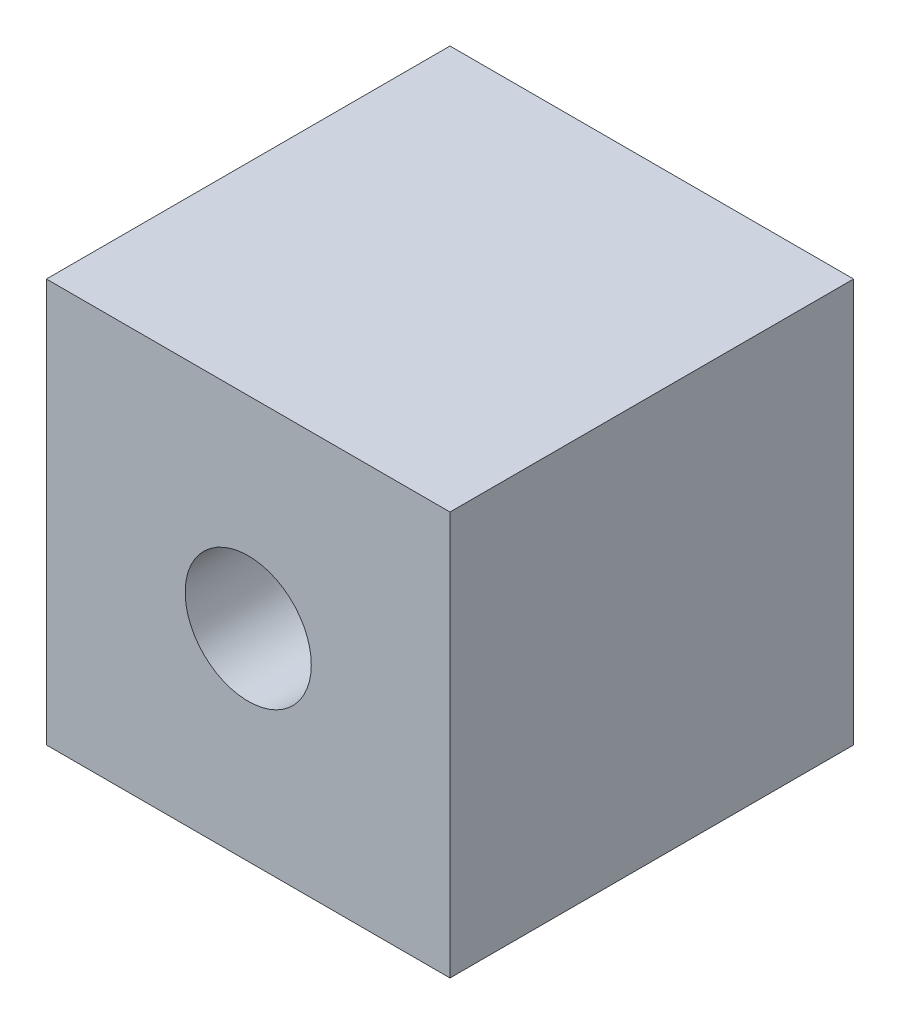
ISO-10303-21;
HEADER;
FILE_DESCRIPTION(('STEP AP214'),'2;1');
FILE_NAME('part.step','',(''),(''),'','','');
FILE_SCHEMA(('AUTOMOTIVE_DESIGN { 1 0 10303 214 1 1 1 1 }'));
ENDSEC;
DATA;
#1=APPLICATION_CONTEXT('core data for automotive mechanical design processes');
#2=APPLICATION_PROTOCOL_DEFINITION('international standard','automotive_design',2000,#1);
#3=PRODUCT_CONTEXT('',#1,'mechanical');
#4=PRODUCT('Part','Part','',(#3));
#5=PRODUCT_RELATED_PRODUCT_CATEGORY('part','',(#4));
#6=PRODUCT_DEFINITION_FORMATION('','',#4);
#7=PRODUCT_DEFINITION_CONTEXT('part definition',#1,'design');
#8=PRODUCT_DEFINITION('design','',#6,#7);
#9=PRODUCT_DEFINITION_SHAPE('','',#8);
#10=(LENGTH_UNIT() NAMED_UNIT(*) SI_UNIT(.MILLI.,.METRE.));
#11=(NAMED_UNIT(*) PLANE_ANGLE_UNIT() SI_UNIT($,.RADIAN.));
#12=(NAMED_UNIT(*) SI_UNIT($,.STERADIAN.) SOLID_ANGLE_UNIT());
#13=UNCERTAINTY_MEASURE_WITH_UNIT(LENGTH_MEASURE(1.E-05),#10,'distance_accuracy_value','');
#14=(GEOMETRIC_REPRESENTATION_CONTEXT(3) GLOBAL_UNCERTAINTY_ASSIGNED_CONTEXT((#13)) GLOBAL_UNIT_ASSIGNED_CONTEXT((#10,
#11,#12)) REPRESENTATION_CONTEXT('',''));
#15=CARTESIAN_POINT('',(0.,0.,0.));
#16=DIRECTION('',(0.,0.,1.));
#17=DIRECTION('',(1.,0.,0.));
#18=AXIS2_PLACEMENT_3D('',#15,#16,#17);
#19=CARTESIAN_POINT('',(24.,48.,24.));
#20=DIRECTION('',(-1.,0.,0.));
#21=DIRECTION('',(0.,0.,1.));
#22=AXIS2_PLACEMENT_3D('',#19,#20,#21);
#23=PLANE('',#22);
#24=DIRECTION('',(0.,0.,-1.));
#25=VECTOR('',#24,1.);
#26=CARTESIAN_POINT('',(24.,0.,24.));
#27=LINE('',#26,#25);
#28=CARTESIAN_POINT('',(24.,0.,24.));
#29=VERTEX_POINT('',#28);
#30=CARTESIAN_POINT('',(24.,0.,-24.));
#31=VERTEX_POINT('',#30);
#32=EDGE_CURVE('E95',#29,#31,#27,.T.);
#33=ORIENTED_EDGE('',*,*,#32,.T.);
#34=DIRECTION('',(0.,-1.,0.));
#35=VECTOR('',#34,1.);
#36=CARTESIAN_POINT('',(24.,48.,-24.));
#37=LINE('',#36,#35);
#38=CARTESIAN_POINT('',(24.,48.,-24.));
#39=VERTEX_POINT('',#38);
#40=EDGE_CURVE('E11',#39,#31,#37,.T.);
#41=ORIENTED_EDGE('',*,*,#40,.F.);
#42=DIRECTION('',(0.,0.,-1.));
#43=VECTOR('',#42,1.);
#44=CARTESIAN_POINT('',(24.,48.,24.));
#45=LINE('',#44,#43);
#46=CARTESIAN_POINT('',(24.,48.,24.));
#47=VERTEX_POINT('',#46);
#48=EDGE_CURVE('E83',#47,#39,#45,.T.);
#49=ORIENTED_EDGE('',*,*,#48,.F.);
#50=DIRECTION('',(0.,-1.,0.));
#51=VECTOR('',#50,1.);
#52=CARTESIAN_POINT('',(24.,48.,24.));
#53=LINE('',#52,#51);
#54=EDGE_CURVE('E91',#47,#29,#53,.T.);
#55=ORIENTED_EDGE('',*,*,#54,.T.);
#56=EDGE_LOOP('',(#33,#41,#49,#55));
#57=FACE_BOUND('',#56,.T.);
#58=ADVANCED_FACE('F32',(#57),#23,.F.);
#59=CARTESIAN_POINT('',(-24.,48.,-24.));
#60=DIRECTION('',(0.,0.,1.));
#61=DIRECTION('',(1.,0.,0.));
#62=AXIS2_PLACEMENT_3D('',#59,#60,#61);
#63=PLANE('',#62);
#64=CARTESIAN_POINT('',(0.,24.,-24.));
#65=DIRECTION('',(0.,0.,1.));
#66=DIRECTION('',(1.,0.,0.));
#67=AXIS2_PLACEMENT_3D('',#64,#65,#66);
#68=CIRCLE('',#67,7.5);
#69=CARTESIAN_POINT('',(7.5,24.,-24.));
#70=VERTEX_POINT('',#69);
#71=EDGE_CURVE('E98',#70,#70,#68,.T.);
#72=ORIENTED_EDGE('',*,*,#71,.T.);
#73=EDGE_LOOP('',(#72));
#74=FACE_BOUND('',#73,.T.);
#75=DIRECTION('',(-1.,0.,0.));
#76=VECTOR('',#75,1.);
#77=CARTESIAN_POINT('',(-24.,0.,-24.));
#78=LINE('',#77,#76);
#79=CARTESIAN_POINT('',(-24.,0.,-24.));
#80=VERTEX_POINT('',#79);
#81=EDGE_CURVE('E87',#31,#80,#78,.T.);
#82=ORIENTED_EDGE('',*,*,#81,.T.);
#83=DIRECTION('',(0.,-1.,0.));
#84=VECTOR('',#83,1.);
#85=CARTESIAN_POINT('',(-24.,48.,-24.));
#86=LINE('',#85,#84);
#87=CARTESIAN_POINT('',(-24.,48.,-24.));
#88=VERTEX_POINT('',#87);
#89=EDGE_CURVE('E40',#88,#80,#86,.T.);
#90=ORIENTED_EDGE('',*,*,#89,.F.);
#91=DIRECTION('',(-1.,0.,0.));
#92=VECTOR('',#91,1.);
#93=CARTESIAN_POINT('',(-24.,48.,-24.));
#94=LINE('',#93,#92);
#95=EDGE_CURVE('E78',#39,#88,#94,.T.);
#96=ORIENTED_EDGE('',*,*,#95,.F.);
#97=ORIENTED_EDGE('',*,*,#40,.T.);
#98=EDGE_LOOP('',(#82,#90,#96,#97));
#99=FACE_BOUND('',#98,.T.);
#100=ADVANCED_FACE('F86',(#74,#99),#63,.F.);
#101=CARTESIAN_POINT('',(-24.,48.,24.));
#102=DIRECTION('',(1.,0.,0.));
#103=DIRECTION('',(0.,0.,-1.));
#104=AXIS2_PLACEMENT_3D('',#101,#102,#103);
#105=PLANE('',#104);
#106=DIRECTION('',(0.,0.,1.));
#107=VECTOR('',#106,1.);
#108=CARTESIAN_POINT('',(-24.,0.,24.));
#109=LINE('',#108,#107);
#110=CARTESIAN_POINT('',(-24.,0.,24.));
#111=VERTEX_POINT('',#110);
#112=EDGE_CURVE('E65',#80,#111,#109,.T.);
#113=ORIENTED_EDGE('',*,*,#112,.T.);
#114=DIRECTION('',(0.,-1.,0.));
#115=VECTOR('',#114,1.);
#116=CARTESIAN_POINT('',(-24.,48.,24.));
#117=LINE('',#116,#115);
#118=CARTESIAN_POINT('',(-24.,48.,24.));
#119=VERTEX_POINT('',#118);
#120=EDGE_CURVE('E88',#119,#111,#117,.T.);
#121=ORIENTED_EDGE('',*,*,#120,.F.);
#122=DIRECTION('',(0.,0.,1.));
#123=VECTOR('',#122,1.);
#124=CARTESIAN_POINT('',(-24.,48.,24.));
#125=LINE('',#124,#123);
#126=EDGE_CURVE('E81',#88,#119,#125,.T.);
#127=ORIENTED_EDGE('',*,*,#126,.F.);
#128=ORIENTED_EDGE('',*,*,#89,.T.);
#129=EDGE_LOOP('',(#113,#121,#127,#128));
#130=FACE_BOUND('',#129,.T.);
#131=ADVANCED_FACE('F89',(#130),#105,.F.);
#132=CARTESIAN_POINT('',(-24.,48.,24.));
#133=DIRECTION('',(0.,0.,-1.));
#134=DIRECTION('',(-1.,0.,0.));
#135=AXIS2_PLACEMENT_3D('',#132,#133,#134);
#136=PLANE('',#135);
#137=CARTESIAN_POINT('',(0.,24.,24.));
#138=DIRECTION('',(0.,0.,1.));
#139=DIRECTION('',(1.,0.,0.));
#140=AXIS2_PLACEMENT_3D('',#137,#138,#139);
#141=CIRCLE('',#140,7.5);
#142=CARTESIAN_POINT('',(7.5,24.,24.));
#143=VERTEX_POINT('',#142);
#144=EDGE_CURVE('E109',#143,#143,#141,.T.);
#145=ORIENTED_EDGE('',*,*,#144,.F.);
#146=EDGE_LOOP('',(#145));
#147=FACE_BOUND('',#146,.T.);
#148=DIRECTION('',(1.,0.,0.));
#149=VECTOR('',#148,1.);
#150=CARTESIAN_POINT('',(-24.,0.,24.));
#151=LINE('',#150,#149);
#152=EDGE_CURVE('E71',#111,#29,#151,.T.);
#153=ORIENTED_EDGE('',*,*,#152,.T.);
#154=ORIENTED_EDGE('',*,*,#54,.F.);
#155=DIRECTION('',(1.,0.,0.));
#156=VECTOR('',#155,1.);
#157=CARTESIAN_POINT('',(-24.,48.,24.));
#158=LINE('',#157,#156);
#159=EDGE_CURVE('E48',#119,#47,#158,.T.);
#160=ORIENTED_EDGE('',*,*,#159,.F.);
#161=ORIENTED_EDGE('',*,*,#120,.T.);
#162=EDGE_LOOP('',(#153,#154,#160,#161));
#163=FACE_BOUND('',#162,.T.);
#164=ADVANCED_FACE('F103',(#147,#163),#136,.F.);
#165=CARTESIAN_POINT('',(0.,48.,0.));
#166=DIRECTION('',(0.,-1.,0.));
#167=DIRECTION('',(0.,0.,-1.));
#168=AXIS2_PLACEMENT_3D('',#165,#166,#167);
#169=PLANE('',#168);
#170=ORIENTED_EDGE('',*,*,#48,.T.);
#171=ORIENTED_EDGE('',*,*,#95,.T.);
#172=ORIENTED_EDGE('',*,*,#126,.T.);
#173=ORIENTED_EDGE('',*,*,#159,.T.);
#174=EDGE_LOOP('',(#170,#171,#172,#173));
#175=FACE_BOUND('',#174,.T.);
#176=ADVANCED_FACE('F79',(#175),#169,.F.);
#177=CARTESIAN_POINT('',(0.,0.,0.));
#178=DIRECTION('',(0.,-1.,0.));
#179=DIRECTION('',(0.,0.,-1.));
#180=AXIS2_PLACEMENT_3D('',#177,#178,#179);
#181=PLANE('',#180);
#182=ORIENTED_EDGE('',*,*,#32,.F.);
#183=ORIENTED_EDGE('',*,*,#152,.F.);
#184=ORIENTED_EDGE('',*,*,#112,.F.);
#185=ORIENTED_EDGE('',*,*,#81,.F.);
#186=EDGE_LOOP('',(#182,#183,#184,#185));
#187=FACE_BOUND('',#186,.T.);
#188=ADVANCED_FACE('F106',(#187),#181,.T.);
#189=CARTESIAN_POINT('',(0.,24.,-24.));
#190=DIRECTION('',(0.,0.,1.));
#191=DIRECTION('',(1.,0.,0.));
#192=AXIS2_PLACEMENT_3D('',#189,#190,#191);
#193=CYLINDRICAL_SURFACE('',#192,7.5);
#194=ORIENTED_EDGE('',*,*,#71,.F.);
#195=EDGE_LOOP('',(#194));
#196=FACE_BOUND('',#195,.T.);
#197=ORIENTED_EDGE('',*,*,#144,.T.);
#198=EDGE_LOOP('',(#197));
#199=FACE_BOUND('',#198,.T.);
#200=ADVANCED_FACE('F116',(#196,#199),#193,.F.);
#201=CLOSED_SHELL('',(#58,#100,#131,#164,#176,#188,#200));
#202=MANIFOLD_SOLID_BREP('B2',#201);
#203=ADVANCED_BREP_SHAPE_REPRESENTATION('',(#18,#202),#14);
#204=SHAPE_DEFINITION_REPRESENTATION(#9,#203);
ENDSEC;
END-ISO-10303-21;
